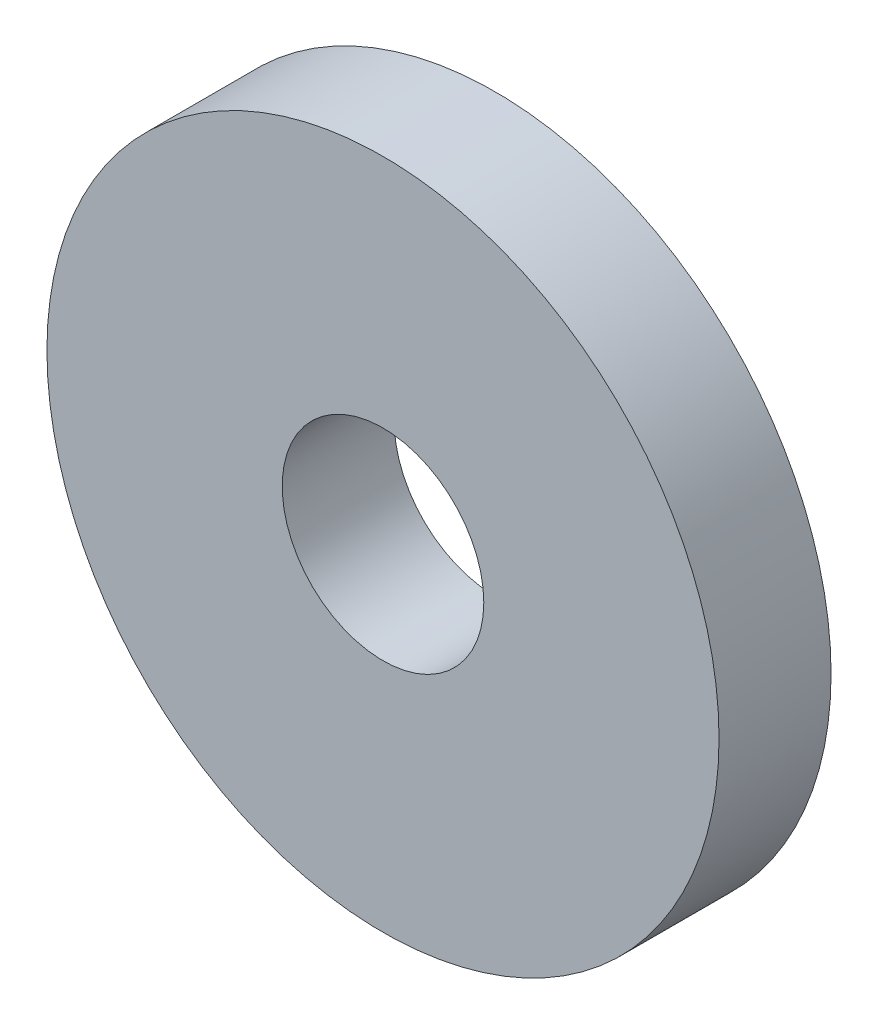
ISO-10303-21;
HEADER;
FILE_DESCRIPTION(('STEP AP214'),'2;1');
FILE_NAME('part.step','',(''),(''),'','','');
FILE_SCHEMA(('AUTOMOTIVE_DESIGN { 1 0 10303 214 1 1 1 1 }'));
ENDSEC;
DATA;
#1=APPLICATION_CONTEXT('core data for automotive mechanical design processes');
#2=APPLICATION_PROTOCOL_DEFINITION('international standard','automotive_design',2000,#1);
#3=PRODUCT_CONTEXT('',#1,'mechanical');
#4=PRODUCT('Part','Part','',(#3));
#5=PRODUCT_RELATED_PRODUCT_CATEGORY('part','',(#4));
#6=PRODUCT_DEFINITION_FORMATION('','',#4);
#7=PRODUCT_DEFINITION_CONTEXT('part definition',#1,'design');
#8=PRODUCT_DEFINITION('design','',#6,#7);
#9=PRODUCT_DEFINITION_SHAPE('','',#8);
#10=(LENGTH_UNIT() NAMED_UNIT(*) SI_UNIT(.MILLI.,.METRE.));
#11=(NAMED_UNIT(*) PLANE_ANGLE_UNIT() SI_UNIT($,.RADIAN.));
#12=(NAMED_UNIT(*) SI_UNIT($,.STERADIAN.) SOLID_ANGLE_UNIT());
#13=UNCERTAINTY_MEASURE_WITH_UNIT(LENGTH_MEASURE(1.E-05),#10,'distance_accuracy_value','');
#14=(GEOMETRIC_REPRESENTATION_CONTEXT(3) GLOBAL_UNCERTAINTY_ASSIGNED_CONTEXT((#13)) GLOBAL_UNIT_ASSIGNED_CONTEXT((#10,
#11,#12)) REPRESENTATION_CONTEXT('',''));
#15=CARTESIAN_POINT('',(0.,0.,0.));
#16=DIRECTION('',(0.,0.,1.));
#17=DIRECTION('',(1.,0.,0.));
#18=AXIS2_PLACEMENT_3D('',#15,#16,#17);
#19=CARTESIAN_POINT('',(0.,0.,10.));
#20=DIRECTION('',(0.,0.,1.));
#21=DIRECTION('',(1.,0.,0.));
#22=AXIS2_PLACEMENT_3D('',#19,#20,#21);
#23=PLANE('',#22);
#24=CARTESIAN_POINT('',(0.,0.,10.));
#25=DIRECTION('',(0.,0.,1.));
#26=DIRECTION('',(1.,0.,0.));
#27=AXIS2_PLACEMENT_3D('',#24,#25,#26);
#28=CIRCLE('',#27,30.);
#29=CARTESIAN_POINT('',(30.,0.,10.));
#30=VERTEX_POINT('',#29);
#31=EDGE_CURVE('E10',#30,#30,#28,.T.);
#32=ORIENTED_EDGE('',*,*,#31,.T.);
#33=EDGE_LOOP('',(#32));
#34=FACE_BOUND('',#33,.T.);
#35=CARTESIAN_POINT('',(0.,0.,10.));
#36=DIRECTION('',(0.,0.,1.));
#37=DIRECTION('',(1.,0.,0.));
#38=AXIS2_PLACEMENT_3D('',#35,#36,#37);
#39=CIRCLE('',#38,9.);
#40=CARTESIAN_POINT('',(9.,0.,10.));
#41=VERTEX_POINT('',#40);
#42=EDGE_CURVE('E42',#41,#41,#39,.T.);
#43=ORIENTED_EDGE('',*,*,#42,.F.);
#44=EDGE_LOOP('',(#43));
#45=FACE_BOUND('',#44,.T.);
#46=ADVANCED_FACE('F31',(#34,#45),#23,.T.);
#47=CARTESIAN_POINT('',(0.,0.,0.));
#48=DIRECTION('',(0.,0.,1.));
#49=DIRECTION('',(1.,0.,0.));
#50=AXIS2_PLACEMENT_3D('',#47,#48,#49);
#51=PLANE('',#50);
#52=CARTESIAN_POINT('',(0.,0.,0.));
#53=DIRECTION('',(0.,0.,1.));
#54=DIRECTION('',(1.,0.,0.));
#55=AXIS2_PLACEMENT_3D('',#52,#53,#54);
#56=CIRCLE('',#55,30.);
#57=CARTESIAN_POINT('',(30.,0.,0.));
#58=VERTEX_POINT('',#57);
#59=EDGE_CURVE('E35',#58,#58,#56,.T.);
#60=ORIENTED_EDGE('',*,*,#59,.F.);
#61=EDGE_LOOP('',(#60));
#62=FACE_BOUND('',#61,.T.);
#63=CARTESIAN_POINT('',(0.,0.,0.));
#64=DIRECTION('',(0.,0.,1.));
#65=DIRECTION('',(1.,0.,0.));
#66=AXIS2_PLACEMENT_3D('',#63,#64,#65);
#67=CIRCLE('',#66,9.);
#68=CARTESIAN_POINT('',(9.,0.,0.));
#69=VERTEX_POINT('',#68);
#70=EDGE_CURVE('E44',#69,#69,#67,.T.);
#71=ORIENTED_EDGE('',*,*,#70,.T.);
#72=EDGE_LOOP('',(#71));
#73=FACE_BOUND('',#72,.T.);
#74=ADVANCED_FACE('F54',(#62,#73),#51,.F.);
#75=CARTESIAN_POINT('',(0.,0.,10.));
#76=DIRECTION('',(0.,0.,-1.));
#77=DIRECTION('',(-1.,0.,0.));
#78=AXIS2_PLACEMENT_3D('',#75,#76,#77);
#79=CYLINDRICAL_SURFACE('',#78,30.);
#80=ORIENTED_EDGE('',*,*,#31,.F.);
#81=EDGE_LOOP('',(#80));
#82=FACE_BOUND('',#81,.T.);
#83=ORIENTED_EDGE('',*,*,#59,.T.);
#84=EDGE_LOOP('',(#83));
#85=FACE_BOUND('',#84,.T.);
#86=ADVANCED_FACE('F33',(#82,#85),#79,.T.);
#87=CARTESIAN_POINT('',(0.,0.,10.));
#88=DIRECTION('',(0.,0.,-1.));
#89=DIRECTION('',(-1.,0.,0.));
#90=AXIS2_PLACEMENT_3D('',#87,#88,#89);
#91=CYLINDRICAL_SURFACE('',#90,9.);
#92=ORIENTED_EDGE('',*,*,#42,.T.);
#93=EDGE_LOOP('',(#92));
#94=FACE_BOUND('',#93,.T.);
#95=ORIENTED_EDGE('',*,*,#70,.F.);
#96=EDGE_LOOP('',(#95));
#97=FACE_BOUND('',#96,.T.);
#98=ADVANCED_FACE('F50',(#94,#97),#91,.F.);
#99=CLOSED_SHELL('',(#46,#74,#86,#98));
#100=MANIFOLD_SOLID_BREP('B2',#99);
#101=ADVANCED_BREP_SHAPE_REPRESENTATION('',(#18,#100),#14);
#102=SHAPE_DEFINITION_REPRESENTATION(#9,#101);
ENDSEC;
END-ISO-10303-21;
